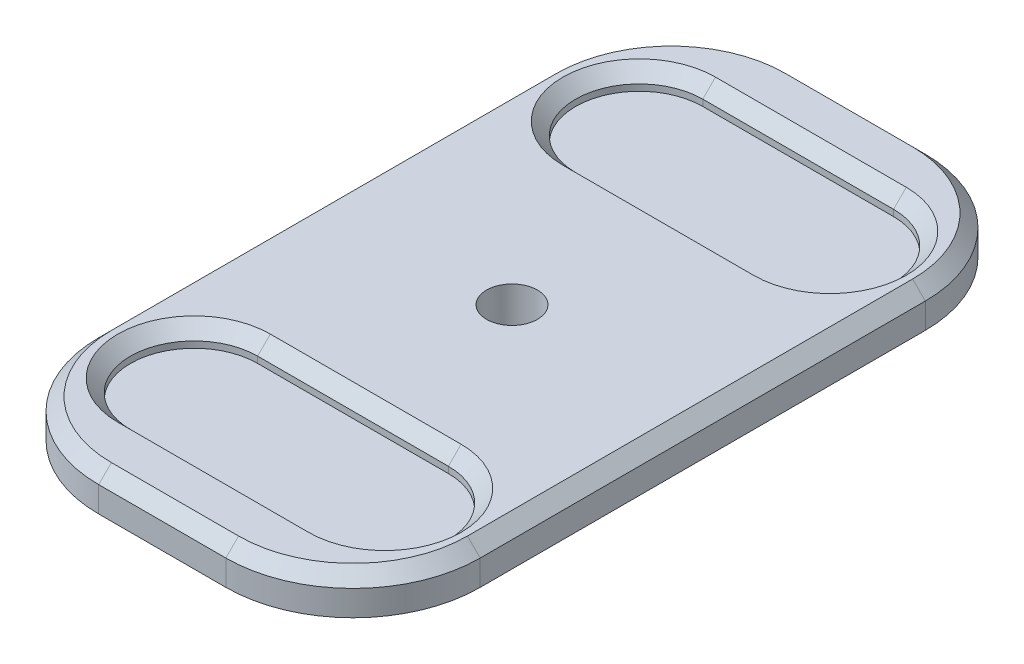
ISO-10303-21;
HEADER;
FILE_DESCRIPTION(('STEP AP214'),'2;1');
FILE_NAME('part.step','',(''),(''),'','','');
FILE_SCHEMA(('AUTOMOTIVE_DESIGN { 1 0 10303 214 1 1 1 1 }'));
ENDSEC;
DATA;
#1=APPLICATION_CONTEXT('core data for automotive mechanical design processes');
#2=APPLICATION_PROTOCOL_DEFINITION('international standard','automotive_design',2000,#1);
#3=PRODUCT_CONTEXT('',#1,'mechanical');
#4=PRODUCT('Part','Part','',(#3));
#5=PRODUCT_RELATED_PRODUCT_CATEGORY('part','',(#4));
#6=PRODUCT_DEFINITION_FORMATION('','',#4);
#7=PRODUCT_DEFINITION_CONTEXT('part definition',#1,'design');
#8=PRODUCT_DEFINITION('design','',#6,#7);
#9=PRODUCT_DEFINITION_SHAPE('','',#8);
#10=(LENGTH_UNIT() NAMED_UNIT(*) SI_UNIT(.MILLI.,.METRE.));
#11=(NAMED_UNIT(*) PLANE_ANGLE_UNIT() SI_UNIT($,.RADIAN.));
#12=(NAMED_UNIT(*) SI_UNIT($,.STERADIAN.) SOLID_ANGLE_UNIT());
#13=UNCERTAINTY_MEASURE_WITH_UNIT(LENGTH_MEASURE(1.E-05),#10,'distance_accuracy_value','');
#14=(GEOMETRIC_REPRESENTATION_CONTEXT(3) GLOBAL_UNCERTAINTY_ASSIGNED_CONTEXT((#13)) GLOBAL_UNIT_ASSIGNED_CONTEXT((#10,
#11,#12)) REPRESENTATION_CONTEXT('',''));
#15=CARTESIAN_POINT('',(0.,0.,0.));
#16=DIRECTION('',(0.,0.,1.));
#17=DIRECTION('',(1.,0.,0.));
#18=AXIS2_PLACEMENT_3D('',#15,#16,#17);
#19=CARTESIAN_POINT('',(30.,3.,0.));
#20=DIRECTION('',(-1.,0.,0.));
#21=DIRECTION('',(0.,0.,1.));
#22=AXIS2_PLACEMENT_3D('',#19,#20,#21);
#23=PLANE('',#22);
#24=DIRECTION('',(0.,1.,0.));
#25=VECTOR('',#24,1.);
#26=CARTESIAN_POINT('',(30.,3.,25.));
#27=LINE('',#26,#25);
#28=CARTESIAN_POINT('',(30.,-3.,25.));
#29=VERTEX_POINT('',#28);
#30=CARTESIAN_POINT('',(30.,0.999999999999984,25.));
#31=VERTEX_POINT('',#30);
#32=EDGE_CURVE('E264',#29,#31,#27,.T.);
#33=ORIENTED_EDGE('',*,*,#32,.T.);
#34=DIRECTION('',(0.,0.,1.));
#35=VECTOR('',#34,1.);
#36=CARTESIAN_POINT('',(30.,0.999999999999984,95.));
#37=LINE('',#36,#35);
#38=CARTESIAN_POINT('',(30.,0.999999999999984,95.));
#39=VERTEX_POINT('',#38);
#40=EDGE_CURVE('E340',#31,#39,#37,.T.);
#41=ORIENTED_EDGE('',*,*,#40,.T.);
#42=DIRECTION('',(0.,1.,0.));
#43=VECTOR('',#42,1.);
#44=CARTESIAN_POINT('',(30.,-3.,95.));
#45=LINE('',#44,#43);
#46=CARTESIAN_POINT('',(30.,-3.,95.));
#47=VERTEX_POINT('',#46);
#48=EDGE_CURVE('E267',#39,#47,#45,.F.);
#49=ORIENTED_EDGE('',*,*,#48,.T.);
#50=DIRECTION('',(0.,0.,1.));
#51=VECTOR('',#50,1.);
#52=CARTESIAN_POINT('',(30.,-3.,140.));
#53=LINE('',#52,#51);
#54=EDGE_CURVE('E253',#29,#47,#53,.T.);
#55=ORIENTED_EDGE('',*,*,#54,.F.);
#56=EDGE_LOOP('',(#33,#41,#49,#55));
#57=FACE_BOUND('',#56,.T.);
#58=ADVANCED_FACE('F32',(#57),#23,.F.);
#59=CARTESIAN_POINT('',(-30.,3.,0.));
#60=DIRECTION('',(1.,0.,0.));
#61=DIRECTION('',(0.,0.,-1.));
#62=AXIS2_PLACEMENT_3D('',#59,#60,#61);
#63=PLANE('',#62);
#64=DIRECTION('',(0.,1.,0.));
#65=VECTOR('',#64,1.);
#66=CARTESIAN_POINT('',(-30.,3.,95.));
#67=LINE('',#66,#65);
#68=CARTESIAN_POINT('',(-30.,-3.,95.));
#69=VERTEX_POINT('',#68);
#70=CARTESIAN_POINT('',(-30.,0.999999999999984,95.));
#71=VERTEX_POINT('',#70);
#72=EDGE_CURVE('E279',#69,#71,#67,.T.);
#73=ORIENTED_EDGE('',*,*,#72,.T.);
#74=DIRECTION('',(0.,0.,-1.));
#75=VECTOR('',#74,1.);
#76=CARTESIAN_POINT('',(-30.,0.999999999999984,25.));
#77=LINE('',#76,#75);
#78=CARTESIAN_POINT('',(-30.,0.999999999999987,25.));
#79=VERTEX_POINT('',#78);
#80=EDGE_CURVE('E332',#71,#79,#77,.T.);
#81=ORIENTED_EDGE('',*,*,#80,.T.);
#82=DIRECTION('',(0.,1.,0.));
#83=VECTOR('',#82,1.);
#84=CARTESIAN_POINT('',(-30.,-3.,25.));
#85=LINE('',#84,#83);
#86=CARTESIAN_POINT('',(-30.,-3.,25.));
#87=VERTEX_POINT('',#86);
#88=EDGE_CURVE('E277',#79,#87,#85,.F.);
#89=ORIENTED_EDGE('',*,*,#88,.T.);
#90=DIRECTION('',(0.,0.,-1.));
#91=VECTOR('',#90,1.);
#92=CARTESIAN_POINT('',(-30.,-3.,140.));
#93=LINE('',#92,#91);
#94=EDGE_CURVE('E250',#69,#87,#93,.T.);
#95=ORIENTED_EDGE('',*,*,#94,.F.);
#96=EDGE_LOOP('',(#73,#81,#89,#95));
#97=FACE_BOUND('',#96,.T.);
#98=ADVANCED_FACE('F427',(#97),#63,.F.);
#99=CARTESIAN_POINT('',(0.,-3.,0.));
#100=DIRECTION('',(0.,-1.,0.));
#101=DIRECTION('',(0.,0.,-1.));
#102=AXIS2_PLACEMENT_3D('',#99,#100,#101);
#103=PLANE('',#102);
#104=CARTESIAN_POINT('',(0.,-3.,60.));
#105=DIRECTION('',(0.,-1.,0.));
#106=DIRECTION('',(0.,0.,-1.));
#107=AXIS2_PLACEMENT_3D('',#104,#105,#106);
#108=CIRCLE('',#107,4.);
#109=CARTESIAN_POINT('',(0.,-3.,56.));
#110=VERTEX_POINT('',#109);
#111=EDGE_CURVE('E819',#110,#110,#108,.T.);
#112=ORIENTED_EDGE('',*,*,#111,.F.);
#113=EDGE_LOOP('',(#112));
#114=FACE_BOUND('',#113,.T.);
#115=ORIENTED_EDGE('',*,*,#54,.T.);
#116=CARTESIAN_POINT('',(10.,-3.,95.));
#117=DIRECTION('',(0.,-1.,0.));
#118=DIRECTION('',(0.,0.,-1.));
#119=AXIS2_PLACEMENT_3D('',#116,#117,#118);
#120=CIRCLE('',#119,20.);
#121=CARTESIAN_POINT('',(10.,-3.,115.));
#122=VERTEX_POINT('',#121);
#123=EDGE_CURVE('E275',#47,#122,#120,.T.);
#124=ORIENTED_EDGE('',*,*,#123,.T.);
#125=DIRECTION('',(-1.,0.,0.));
#126=VECTOR('',#125,1.);
#127=CARTESIAN_POINT('',(0.,-3.,115.));
#128=LINE('',#127,#126);
#129=CARTESIAN_POINT('',(-9.99999999999998,-3.,115.));
#130=VERTEX_POINT('',#129);
#131=EDGE_CURVE('E256',#122,#130,#128,.T.);
#132=ORIENTED_EDGE('',*,*,#131,.T.);
#133=CARTESIAN_POINT('',(-9.99999999999998,-3.,95.));
#134=DIRECTION('',(0.,-1.,0.));
#135=DIRECTION('',(0.,0.,-1.));
#136=AXIS2_PLACEMENT_3D('',#133,#134,#135);
#137=CIRCLE('',#136,20.);
#138=EDGE_CURVE('E273',#130,#69,#137,.T.);
#139=ORIENTED_EDGE('',*,*,#138,.T.);
#140=ORIENTED_EDGE('',*,*,#94,.T.);
#141=CARTESIAN_POINT('',(-9.99999999999999,-3.,25.));
#142=DIRECTION('',(0.,-1.,0.));
#143=DIRECTION('',(0.,0.,-1.));
#144=AXIS2_PLACEMENT_3D('',#141,#142,#143);
#145=CIRCLE('',#144,20.);
#146=CARTESIAN_POINT('',(-9.99999999999999,-3.,5.));
#147=VERTEX_POINT('',#146);
#148=EDGE_CURVE('E269',#87,#147,#145,.T.);
#149=ORIENTED_EDGE('',*,*,#148,.T.);
#150=DIRECTION('',(1.,0.,0.));
#151=VECTOR('',#150,1.);
#152=CARTESIAN_POINT('',(30.,-3.,5.));
#153=LINE('',#152,#151);
#154=CARTESIAN_POINT('',(10.,-3.,5.));
#155=VERTEX_POINT('',#154);
#156=EDGE_CURVE('E228',#147,#155,#153,.T.);
#157=ORIENTED_EDGE('',*,*,#156,.T.);
#158=CARTESIAN_POINT('',(10.,-3.,25.));
#159=DIRECTION('',(0.,-1.,0.));
#160=DIRECTION('',(0.,0.,-1.));
#161=AXIS2_PLACEMENT_3D('',#158,#159,#160);
#162=CIRCLE('',#161,20.);
#163=EDGE_CURVE('E271',#155,#29,#162,.T.);
#164=ORIENTED_EDGE('',*,*,#163,.T.);
#165=EDGE_LOOP('',(#115,#124,#132,#139,#140,#149,#157,#164));
#166=FACE_BOUND('',#165,.T.);
#167=ADVANCED_FACE('F418',(#114,#166),#103,.T.);
#168=CARTESIAN_POINT('',(0.,3.,0.));
#169=DIRECTION('',(0.,1.,0.));
#170=DIRECTION('',(0.,0.,1.));
#171=AXIS2_PLACEMENT_3D('',#168,#169,#170);
#172=PLANE('',#171);
#173=CARTESIAN_POINT('',(0.,3.,60.));
#174=DIRECTION('',(0.,1.,0.));
#175=DIRECTION('',(0.,0.,1.));
#176=AXIS2_PLACEMENT_3D('',#173,#174,#175);
#177=CIRCLE('',#176,4.);
#178=CARTESIAN_POINT('',(0.,3.,64.));
#179=VERTEX_POINT('',#178);
#180=EDGE_CURVE('E36',#179,#179,#177,.T.);
#181=ORIENTED_EDGE('',*,*,#180,.F.);
#182=EDGE_LOOP('',(#181));
#183=FACE_BOUND('',#182,.T.);
#184=DIRECTION('',(1.,0.,0.));
#185=VECTOR('',#184,1.);
#186=CARTESIAN_POINT('',(15.,3.,13.));
#187=LINE('',#186,#185);
#188=CARTESIAN_POINT('',(-15.,3.,13.));
#189=VERTEX_POINT('',#188);
#190=CARTESIAN_POINT('',(15.,3.,13.));
#191=VERTEX_POINT('',#190);
#192=EDGE_CURVE('E319',#189,#191,#187,.T.);
#193=ORIENTED_EDGE('',*,*,#192,.T.);
#194=CARTESIAN_POINT('',(15.,3.,25.));
#195=DIRECTION('',(0.,1.,0.));
#196=DIRECTION('',(0.,0.,1.));
#197=AXIS2_PLACEMENT_3D('',#194,#195,#196);
#198=CIRCLE('',#197,12.);
#199=CARTESIAN_POINT('',(15.,3.,37.));
#200=VERTEX_POINT('',#199);
#201=EDGE_CURVE('E321',#191,#200,#198,.F.);
#202=ORIENTED_EDGE('',*,*,#201,.T.);
#203=DIRECTION('',(-1.,0.,0.));
#204=VECTOR('',#203,1.);
#205=CARTESIAN_POINT('',(-15.,3.,37.));
#206=LINE('',#205,#204);
#207=CARTESIAN_POINT('',(-15.,3.,37.));
#208=VERTEX_POINT('',#207);
#209=EDGE_CURVE('E315',#200,#208,#206,.T.);
#210=ORIENTED_EDGE('',*,*,#209,.T.);
#211=CARTESIAN_POINT('',(-15.,3.,25.));
#212=DIRECTION('',(0.,1.,0.));
#213=DIRECTION('',(0.,0.,1.));
#214=AXIS2_PLACEMENT_3D('',#211,#212,#213);
#215=CIRCLE('',#214,12.);
#216=EDGE_CURVE('E317',#208,#189,#215,.F.);
#217=ORIENTED_EDGE('',*,*,#216,.T.);
#218=EDGE_LOOP('',(#193,#202,#210,#217));
#219=FACE_BOUND('',#218,.T.);
#220=DIRECTION('',(0.,0.,1.));
#221=VECTOR('',#220,1.);
#222=CARTESIAN_POINT('',(-28.,3.,95.));
#223=LINE('',#222,#221);
#224=CARTESIAN_POINT('',(-28.,3.,25.));
#225=VERTEX_POINT('',#224);
#226=CARTESIAN_POINT('',(-28.,3.,95.));
#227=VERTEX_POINT('',#226);
#228=EDGE_CURVE('E310',#225,#227,#223,.T.);
#229=ORIENTED_EDGE('',*,*,#228,.T.);
#230=CARTESIAN_POINT('',(-9.99999999999998,3.,95.));
#231=DIRECTION('',(0.,1.,0.));
#232=DIRECTION('',(0.,0.,1.));
#233=AXIS2_PLACEMENT_3D('',#230,#231,#232);
#234=CIRCLE('',#233,18.);
#235=CARTESIAN_POINT('',(-9.99999999999998,3.,113.));
#236=VERTEX_POINT('',#235);
#237=EDGE_CURVE('E312',#227,#236,#234,.T.);
#238=ORIENTED_EDGE('',*,*,#237,.T.);
#239=DIRECTION('',(1.,0.,0.));
#240=VECTOR('',#239,1.);
#241=CARTESIAN_POINT('',(0.,3.,113.));
#242=LINE('',#241,#240);
#243=CARTESIAN_POINT('',(10.,3.,113.));
#244=VERTEX_POINT('',#243);
#245=EDGE_CURVE('E298',#236,#244,#242,.T.);
#246=ORIENTED_EDGE('',*,*,#245,.T.);
#247=CARTESIAN_POINT('',(10.,3.,95.));
#248=DIRECTION('',(0.,1.,0.));
#249=DIRECTION('',(0.,0.,1.));
#250=AXIS2_PLACEMENT_3D('',#247,#248,#249);
#251=CIRCLE('',#250,18.);
#252=CARTESIAN_POINT('',(28.,3.,95.));
#253=VERTEX_POINT('',#252);
#254=EDGE_CURVE('E300',#244,#253,#251,.T.);
#255=ORIENTED_EDGE('',*,*,#254,.T.);
#256=DIRECTION('',(0.,0.,-1.));
#257=VECTOR('',#256,1.);
#258=CARTESIAN_POINT('',(28.,3.,25.));
#259=LINE('',#258,#257);
#260=CARTESIAN_POINT('',(28.,3.,25.));
#261=VERTEX_POINT('',#260);
#262=EDGE_CURVE('E302',#253,#261,#259,.T.);
#263=ORIENTED_EDGE('',*,*,#262,.T.);
#264=CARTESIAN_POINT('',(10.,3.,25.));
#265=DIRECTION('',(0.,1.,0.));
#266=DIRECTION('',(0.,0.,1.));
#267=AXIS2_PLACEMENT_3D('',#264,#265,#266);
#268=CIRCLE('',#267,18.);
#269=CARTESIAN_POINT('',(10.,3.,7.));
#270=VERTEX_POINT('',#269);
#271=EDGE_CURVE('E304',#261,#270,#268,.T.);
#272=ORIENTED_EDGE('',*,*,#271,.T.);
#273=DIRECTION('',(-1.,0.,0.));
#274=VECTOR('',#273,1.);
#275=CARTESIAN_POINT('',(0.,3.,7.));
#276=LINE('',#275,#274);
#277=CARTESIAN_POINT('',(-9.99999999999999,3.,7.));
#278=VERTEX_POINT('',#277);
#279=EDGE_CURVE('E306',#270,#278,#276,.T.);
#280=ORIENTED_EDGE('',*,*,#279,.T.);
#281=CARTESIAN_POINT('',(-9.99999999999999,3.,25.));
#282=DIRECTION('',(0.,1.,0.));
#283=DIRECTION('',(0.,0.,1.));
#284=AXIS2_PLACEMENT_3D('',#281,#282,#283);
#285=CIRCLE('',#284,18.);
#286=EDGE_CURVE('E308',#278,#225,#285,.T.);
#287=ORIENTED_EDGE('',*,*,#286,.T.);
#288=EDGE_LOOP('',(#229,#238,#246,#255,#263,#272,#280,#287));
#289=FACE_BOUND('',#288,.T.);
#290=CARTESIAN_POINT('',(-15.,3.,95.));
#291=DIRECTION('',(0.,1.,0.));
#292=DIRECTION('',(0.,0.,1.));
#293=AXIS2_PLACEMENT_3D('',#290,#291,#292);
#294=CIRCLE('',#293,12.);
#295=CARTESIAN_POINT('',(-15.,3.,107.));
#296=VERTEX_POINT('',#295);
#297=CARTESIAN_POINT('',(-15.,3.,83.));
#298=VERTEX_POINT('',#297);
#299=EDGE_CURVE('E293',#296,#298,#294,.F.);
#300=ORIENTED_EDGE('',*,*,#299,.T.);
#301=DIRECTION('',(1.,0.,0.));
#302=VECTOR('',#301,1.);
#303=CARTESIAN_POINT('',(15.,3.,83.));
#304=LINE('',#303,#302);
#305=CARTESIAN_POINT('',(15.,3.,83.));
#306=VERTEX_POINT('',#305);
#307=EDGE_CURVE('E295',#298,#306,#304,.T.);
#308=ORIENTED_EDGE('',*,*,#307,.T.);
#309=CARTESIAN_POINT('',(15.,3.,95.));
#310=DIRECTION('',(0.,1.,0.));
#311=DIRECTION('',(0.,0.,1.));
#312=AXIS2_PLACEMENT_3D('',#309,#310,#311);
#313=CIRCLE('',#312,12.);
#314=CARTESIAN_POINT('',(15.,3.,107.));
#315=VERTEX_POINT('',#314);
#316=EDGE_CURVE('E289',#306,#315,#313,.F.);
#317=ORIENTED_EDGE('',*,*,#316,.T.);
#318=DIRECTION('',(-1.,0.,0.));
#319=VECTOR('',#318,1.);
#320=CARTESIAN_POINT('',(-15.,3.,107.));
#321=LINE('',#320,#319);
#322=EDGE_CURVE('E291',#315,#296,#321,.T.);
#323=ORIENTED_EDGE('',*,*,#322,.T.);
#324=EDGE_LOOP('',(#300,#308,#317,#323));
#325=FACE_BOUND('',#324,.T.);
#326=ADVANCED_FACE('F416',(#183,#219,#289,#325),#172,.T.);
#327=CARTESIAN_POINT('',(15.,3.,95.));
#328=DIRECTION('',(0.,-1.,0.));
#329=DIRECTION('',(0.,0.,-1.));
#330=AXIS2_PLACEMENT_3D('',#327,#328,#329);
#331=CYLINDRICAL_SURFACE('',#330,10.);
#332=DIRECTION('',(0.,-1.,0.));
#333=VECTOR('',#332,1.);
#334=CARTESIAN_POINT('',(15.,3.,105.));
#335=LINE('',#334,#333);
#336=CARTESIAN_POINT('',(15.,1.00000000000003,105.));
#337=VERTEX_POINT('',#336);
#338=CARTESIAN_POINT('',(15.,0.,105.));
#339=VERTEX_POINT('',#338);
#340=EDGE_CURVE('E242',#337,#339,#335,.T.);
#341=ORIENTED_EDGE('',*,*,#340,.F.);
#342=CARTESIAN_POINT('',(15.,1.00000000000003,95.));
#343=DIRECTION('',(0.,1.,0.));
#344=DIRECTION('',(0.,0.,1.));
#345=AXIS2_PLACEMENT_3D('',#342,#343,#344);
#346=CIRCLE('',#345,10.);
#347=CARTESIAN_POINT('',(15.,1.00000000000003,85.));
#348=VERTEX_POINT('',#347);
#349=EDGE_CURVE('E11',#337,#348,#346,.T.);
#350=ORIENTED_EDGE('',*,*,#349,.T.);
#351=DIRECTION('',(0.,-1.,0.));
#352=VECTOR('',#351,1.);
#353=CARTESIAN_POINT('',(15.,3.,85.));
#354=LINE('',#353,#352);
#355=CARTESIAN_POINT('',(15.,0.,85.));
#356=VERTEX_POINT('',#355);
#357=EDGE_CURVE('E248',#348,#356,#354,.T.);
#358=ORIENTED_EDGE('',*,*,#357,.T.);
#359=CARTESIAN_POINT('',(15.,0.,95.));
#360=DIRECTION('',(0.,-1.,0.));
#361=DIRECTION('',(0.,0.,-1.));
#362=AXIS2_PLACEMENT_3D('',#359,#360,#361);
#363=CIRCLE('',#362,10.);
#364=EDGE_CURVE('E206',#356,#339,#363,.T.);
#365=ORIENTED_EDGE('',*,*,#364,.T.);
#366=EDGE_LOOP('',(#341,#350,#358,#365));
#367=FACE_BOUND('',#366,.T.);
#368=ADVANCED_FACE('F406',(#367),#331,.F.);
#369=CARTESIAN_POINT('',(-15.,3.,85.));
#370=DIRECTION('',(0.,0.,-1.));
#371=DIRECTION('',(-1.,0.,0.));
#372=AXIS2_PLACEMENT_3D('',#369,#370,#371);
#373=PLANE('',#372);
#374=ORIENTED_EDGE('',*,*,#357,.F.);
#375=DIRECTION('',(-1.,0.,0.));
#376=VECTOR('',#375,1.);
#377=CARTESIAN_POINT('',(-15.,1.00000000000003,85.));
#378=LINE('',#377,#376);
#379=CARTESIAN_POINT('',(-15.,1.00000000000003,85.));
#380=VERTEX_POINT('',#379);
#381=EDGE_CURVE('E346',#348,#380,#378,.T.);
#382=ORIENTED_EDGE('',*,*,#381,.T.);
#383=DIRECTION('',(0.,-1.,0.));
#384=VECTOR('',#383,1.);
#385=CARTESIAN_POINT('',(-15.,3.,85.));
#386=LINE('',#385,#384);
#387=CARTESIAN_POINT('',(-15.,0.,85.));
#388=VERTEX_POINT('',#387);
#389=EDGE_CURVE('E246',#380,#388,#386,.T.);
#390=ORIENTED_EDGE('',*,*,#389,.T.);
#391=DIRECTION('',(1.,0.,0.));
#392=VECTOR('',#391,1.);
#393=CARTESIAN_POINT('',(-15.,0.,85.));
#394=LINE('',#393,#392);
#395=EDGE_CURVE('E233',#388,#356,#394,.T.);
#396=ORIENTED_EDGE('',*,*,#395,.T.);
#397=EDGE_LOOP('',(#374,#382,#390,#396));
#398=FACE_BOUND('',#397,.T.);
#399=ADVANCED_FACE('F410',(#398),#373,.F.);
#400=CARTESIAN_POINT('',(-15.,3.,95.));
#401=DIRECTION('',(0.,-1.,0.));
#402=DIRECTION('',(0.,0.,-1.));
#403=AXIS2_PLACEMENT_3D('',#400,#401,#402);
#404=CYLINDRICAL_SURFACE('',#403,10.);
#405=ORIENTED_EDGE('',*,*,#389,.F.);
#406=CARTESIAN_POINT('',(-15.,1.00000000000003,95.));
#407=DIRECTION('',(0.,1.,0.));
#408=DIRECTION('',(0.,0.,1.));
#409=AXIS2_PLACEMENT_3D('',#406,#407,#408);
#410=CIRCLE('',#409,10.);
#411=CARTESIAN_POINT('',(-15.,1.00000000000003,105.));
#412=VERTEX_POINT('',#411);
#413=EDGE_CURVE('E56',#380,#412,#410,.T.);
#414=ORIENTED_EDGE('',*,*,#413,.T.);
#415=DIRECTION('',(0.,-1.,0.));
#416=VECTOR('',#415,1.);
#417=CARTESIAN_POINT('',(-15.,3.,105.));
#418=LINE('',#417,#416);
#419=CARTESIAN_POINT('',(-15.,0.,105.));
#420=VERTEX_POINT('',#419);
#421=EDGE_CURVE('E244',#412,#420,#418,.T.);
#422=ORIENTED_EDGE('',*,*,#421,.T.);
#423=CARTESIAN_POINT('',(-15.,0.,95.));
#424=DIRECTION('',(0.,-1.,0.));
#425=DIRECTION('',(0.,0.,-1.));
#426=AXIS2_PLACEMENT_3D('',#423,#424,#425);
#427=CIRCLE('',#426,10.);
#428=EDGE_CURVE('E236',#420,#388,#427,.T.);
#429=ORIENTED_EDGE('',*,*,#428,.T.);
#430=EDGE_LOOP('',(#405,#414,#422,#429));
#431=FACE_BOUND('',#430,.T.);
#432=ADVANCED_FACE('F661',(#431),#404,.F.);
#433=CARTESIAN_POINT('',(-15.,3.,105.));
#434=DIRECTION('',(0.,0.,1.));
#435=DIRECTION('',(1.,0.,0.));
#436=AXIS2_PLACEMENT_3D('',#433,#434,#435);
#437=PLANE('',#436);
#438=ORIENTED_EDGE('',*,*,#421,.F.);
#439=DIRECTION('',(1.,0.,0.));
#440=VECTOR('',#439,1.);
#441=CARTESIAN_POINT('',(15.,1.00000000000003,105.));
#442=LINE('',#441,#440);
#443=EDGE_CURVE('E41',#412,#337,#442,.T.);
#444=ORIENTED_EDGE('',*,*,#443,.T.);
#445=ORIENTED_EDGE('',*,*,#340,.T.);
#446=DIRECTION('',(-1.,0.,0.));
#447=VECTOR('',#446,1.);
#448=CARTESIAN_POINT('',(-15.,0.,105.));
#449=LINE('',#448,#447);
#450=EDGE_CURVE('E239',#339,#420,#449,.T.);
#451=ORIENTED_EDGE('',*,*,#450,.T.);
#452=EDGE_LOOP('',(#438,#444,#445,#451));
#453=FACE_BOUND('',#452,.T.);
#454=ADVANCED_FACE('F654',(#453),#437,.F.);
#455=CARTESIAN_POINT('',(0.,0.,120.));
#456=DIRECTION('',(0.,-1.,0.));
#457=DIRECTION('',(0.,0.,1.));
#458=AXIS2_PLACEMENT_3D('',#455,#456,#457);
#459=PLANE('',#458);
#460=ORIENTED_EDGE('',*,*,#450,.F.);
#461=ORIENTED_EDGE('',*,*,#364,.F.);
#462=ORIENTED_EDGE('',*,*,#395,.F.);
#463=ORIENTED_EDGE('',*,*,#428,.F.);
#464=EDGE_LOOP('',(#460,#461,#462,#463));
#465=FACE_BOUND('',#464,.T.);
#466=ADVANCED_FACE('F643',(#465),#459,.F.);
#467=CARTESIAN_POINT('',(-30.,-7.,115.));
#468=DIRECTION('',(0.,0.,1.));
#469=DIRECTION('',(1.,0.,0.));
#470=AXIS2_PLACEMENT_3D('',#467,#468,#469);
#471=PLANE('',#470);
#472=DIRECTION('',(0.,1.,0.));
#473=VECTOR('',#472,1.);
#474=CARTESIAN_POINT('',(10.,3.,115.));
#475=LINE('',#474,#473);
#476=CARTESIAN_POINT('',(10.,0.999999999999984,115.));
#477=VERTEX_POINT('',#476);
#478=EDGE_CURVE('E261',#122,#477,#475,.T.);
#479=ORIENTED_EDGE('',*,*,#478,.T.);
#480=DIRECTION('',(-1.,0.,0.));
#481=VECTOR('',#480,1.);
#482=CARTESIAN_POINT('',(-30.,0.999999999999984,115.));
#483=LINE('',#482,#481);
#484=CARTESIAN_POINT('',(-9.99999999999998,0.999999999999984,115.));
#485=VERTEX_POINT('',#484);
#486=EDGE_CURVE('E344',#477,#485,#483,.T.);
#487=ORIENTED_EDGE('',*,*,#486,.T.);
#488=DIRECTION('',(0.,1.,0.));
#489=VECTOR('',#488,1.);
#490=CARTESIAN_POINT('',(-9.99999999999998,-3.,115.));
#491=LINE('',#490,#489);
#492=EDGE_CURVE('E259',#485,#130,#491,.F.);
#493=ORIENTED_EDGE('',*,*,#492,.T.);
#494=ORIENTED_EDGE('',*,*,#131,.F.);
#495=EDGE_LOOP('',(#479,#487,#493,#494));
#496=FACE_BOUND('',#495,.T.);
#497=ADVANCED_FACE('F632',(#496),#471,.T.);
#498=CARTESIAN_POINT('',(-30.,-81.3941029804985,5.));
#499=DIRECTION('',(0.,0.,-1.));
#500=DIRECTION('',(-1.,0.,0.));
#501=AXIS2_PLACEMENT_3D('',#498,#499,#500);
#502=PLANE('',#501);
#503=DIRECTION('',(0.,1.,0.));
#504=VECTOR('',#503,1.);
#505=CARTESIAN_POINT('',(-9.99999999999999,3.,5.));
#506=LINE('',#505,#504);
#507=CARTESIAN_POINT('',(-9.99999999999999,0.999999999999987,5.));
#508=VERTEX_POINT('',#507);
#509=EDGE_CURVE('E282',#147,#508,#506,.T.);
#510=ORIENTED_EDGE('',*,*,#509,.T.);
#511=DIRECTION('',(1.,0.,0.));
#512=VECTOR('',#511,1.);
#513=CARTESIAN_POINT('',(-30.,0.999999999999987,5.));
#514=LINE('',#513,#512);
#515=CARTESIAN_POINT('',(10.,0.999999999999984,5.));
#516=VERTEX_POINT('',#515);
#517=EDGE_CURVE('E336',#508,#516,#514,.T.);
#518=ORIENTED_EDGE('',*,*,#517,.T.);
#519=DIRECTION('',(0.,1.,0.));
#520=VECTOR('',#519,1.);
#521=CARTESIAN_POINT('',(10.,-3.,5.));
#522=LINE('',#521,#520);
#523=EDGE_CURVE('E285',#516,#155,#522,.F.);
#524=ORIENTED_EDGE('',*,*,#523,.T.);
#525=ORIENTED_EDGE('',*,*,#156,.F.);
#526=EDGE_LOOP('',(#510,#518,#524,#525));
#527=FACE_BOUND('',#526,.T.);
#528=ADVANCED_FACE('F621',(#527),#502,.T.);
#529=CARTESIAN_POINT('',(-15.,-81.3941029804985,25.));
#530=DIRECTION('',(0.,1.,0.));
#531=DIRECTION('',(0.,0.,1.));
#532=AXIS2_PLACEMENT_3D('',#529,#530,#531);
#533=CYLINDRICAL_SURFACE('',#532,10.);
#534=DIRECTION('',(0.,1.,0.));
#535=VECTOR('',#534,1.);
#536=CARTESIAN_POINT('',(-15.,-81.3941029804985,15.));
#537=LINE('',#536,#535);
#538=CARTESIAN_POINT('',(-15.,0.,15.));
#539=VERTEX_POINT('',#538);
#540=CARTESIAN_POINT('',(-15.,0.999999999999987,15.));
#541=VERTEX_POINT('',#540);
#542=EDGE_CURVE('E225',#539,#541,#537,.T.);
#543=ORIENTED_EDGE('',*,*,#542,.T.);
#544=CARTESIAN_POINT('',(-15.,0.999999999999987,25.));
#545=DIRECTION('',(0.,1.,0.));
#546=DIRECTION('',(0.,0.,1.));
#547=AXIS2_PLACEMENT_3D('',#544,#545,#546);
#548=CIRCLE('',#547,10.);
#549=CARTESIAN_POINT('',(-15.,0.999999999999987,35.));
#550=VERTEX_POINT('',#549);
#551=EDGE_CURVE('E326',#541,#550,#548,.T.);
#552=ORIENTED_EDGE('',*,*,#551,.T.);
#553=DIRECTION('',(0.,1.,0.));
#554=VECTOR('',#553,1.);
#555=CARTESIAN_POINT('',(-15.,-81.3941029804985,35.));
#556=LINE('',#555,#554);
#557=CARTESIAN_POINT('',(-15.,0.,35.));
#558=VERTEX_POINT('',#557);
#559=EDGE_CURVE('E216',#558,#550,#556,.T.);
#560=ORIENTED_EDGE('',*,*,#559,.F.);
#561=CARTESIAN_POINT('',(-15.,0.,25.));
#562=DIRECTION('',(0.,-1.,0.));
#563=DIRECTION('',(0.,0.,-1.));
#564=AXIS2_PLACEMENT_3D('',#561,#562,#563);
#565=CIRCLE('',#564,10.);
#566=EDGE_CURVE('E219',#539,#558,#565,.F.);
#567=ORIENTED_EDGE('',*,*,#566,.F.);
#568=EDGE_LOOP('',(#543,#552,#560,#567));
#569=FACE_BOUND('',#568,.T.);
#570=ADVANCED_FACE('F611',(#569),#533,.F.);
#571=CARTESIAN_POINT('',(-15.,-81.3941029804985,15.));
#572=DIRECTION('',(0.,0.,-1.));
#573=DIRECTION('',(-1.,0.,0.));
#574=AXIS2_PLACEMENT_3D('',#571,#572,#573);
#575=PLANE('',#574);
#576=DIRECTION('',(0.,1.,0.));
#577=VECTOR('',#576,1.);
#578=CARTESIAN_POINT('',(15.,-81.3941029804985,15.));
#579=LINE('',#578,#577);
#580=CARTESIAN_POINT('',(15.,0.,15.));
#581=VERTEX_POINT('',#580);
#582=CARTESIAN_POINT('',(15.,0.999999999999987,15.));
#583=VERTEX_POINT('',#582);
#584=EDGE_CURVE('E202',#581,#583,#579,.T.);
#585=ORIENTED_EDGE('',*,*,#584,.T.);
#586=DIRECTION('',(-1.,0.,0.));
#587=VECTOR('',#586,1.);
#588=CARTESIAN_POINT('',(-15.,0.999999999999987,15.));
#589=LINE('',#588,#587);
#590=EDGE_CURVE('E324',#583,#541,#589,.T.);
#591=ORIENTED_EDGE('',*,*,#590,.T.);
#592=ORIENTED_EDGE('',*,*,#542,.F.);
#593=DIRECTION('',(-1.,0.,0.));
#594=VECTOR('',#593,1.);
#595=CARTESIAN_POINT('',(-15.,0.,15.));
#596=LINE('',#595,#594);
#597=EDGE_CURVE('E221',#581,#539,#596,.T.);
#598=ORIENTED_EDGE('',*,*,#597,.F.);
#599=EDGE_LOOP('',(#585,#591,#592,#598));
#600=FACE_BOUND('',#599,.T.);
#601=ADVANCED_FACE('F602',(#600),#575,.F.);
#602=CARTESIAN_POINT('',(15.,-81.3941029804985,25.));
#603=DIRECTION('',(0.,1.,0.));
#604=DIRECTION('',(0.,0.,1.));
#605=AXIS2_PLACEMENT_3D('',#602,#603,#604);
#606=CYLINDRICAL_SURFACE('',#605,10.);
#607=DIRECTION('',(0.,1.,0.));
#608=VECTOR('',#607,1.);
#609=CARTESIAN_POINT('',(15.,-81.3941029804985,35.));
#610=LINE('',#609,#608);
#611=CARTESIAN_POINT('',(15.,0.,35.));
#612=VERTEX_POINT('',#611);
#613=CARTESIAN_POINT('',(15.,0.999999999999987,35.));
#614=VERTEX_POINT('',#613);
#615=EDGE_CURVE('E199',#612,#614,#610,.T.);
#616=ORIENTED_EDGE('',*,*,#615,.T.);
#617=CARTESIAN_POINT('',(15.,0.999999999999987,25.));
#618=DIRECTION('',(0.,1.,0.));
#619=DIRECTION('',(0.,0.,1.));
#620=AXIS2_PLACEMENT_3D('',#617,#618,#619);
#621=CIRCLE('',#620,10.);
#622=EDGE_CURVE('E287',#614,#583,#621,.T.);
#623=ORIENTED_EDGE('',*,*,#622,.T.);
#624=ORIENTED_EDGE('',*,*,#584,.F.);
#625=CARTESIAN_POINT('',(15.,0.,25.));
#626=DIRECTION('',(0.,-1.,0.));
#627=DIRECTION('',(0.,0.,-1.));
#628=AXIS2_PLACEMENT_3D('',#625,#626,#627);
#629=CIRCLE('',#628,10.);
#630=EDGE_CURVE('E195',#612,#581,#629,.F.);
#631=ORIENTED_EDGE('',*,*,#630,.F.);
#632=EDGE_LOOP('',(#616,#623,#624,#631));
#633=FACE_BOUND('',#632,.T.);
#634=ADVANCED_FACE('F197',(#633),#606,.F.);
#635=CARTESIAN_POINT('',(-15.,-81.3941029804985,35.));
#636=DIRECTION('',(0.,0.,1.));
#637=DIRECTION('',(1.,0.,0.));
#638=AXIS2_PLACEMENT_3D('',#635,#636,#637);
#639=PLANE('',#638);
#640=ORIENTED_EDGE('',*,*,#559,.T.);
#641=DIRECTION('',(1.,0.,0.));
#642=VECTOR('',#641,1.);
#643=CARTESIAN_POINT('',(15.,0.999999999999987,35.));
#644=LINE('',#643,#642);
#645=EDGE_CURVE('E215',#550,#614,#644,.T.);
#646=ORIENTED_EDGE('',*,*,#645,.T.);
#647=ORIENTED_EDGE('',*,*,#615,.F.);
#648=DIRECTION('',(1.,0.,0.));
#649=VECTOR('',#648,1.);
#650=CARTESIAN_POINT('',(-15.,0.,35.));
#651=LINE('',#650,#649);
#652=EDGE_CURVE('E207',#558,#612,#651,.T.);
#653=ORIENTED_EDGE('',*,*,#652,.F.);
#654=EDGE_LOOP('',(#640,#646,#647,#653));
#655=FACE_BOUND('',#654,.T.);
#656=ADVANCED_FACE('F212',(#655),#639,.F.);
#657=CARTESIAN_POINT('',(0.,0.,0.));
#658=DIRECTION('',(0.,-1.,0.));
#659=DIRECTION('',(0.,0.,-1.));
#660=AXIS2_PLACEMENT_3D('',#657,#658,#659);
#661=PLANE('',#660);
#662=ORIENTED_EDGE('',*,*,#597,.T.);
#663=ORIENTED_EDGE('',*,*,#566,.T.);
#664=ORIENTED_EDGE('',*,*,#652,.T.);
#665=ORIENTED_EDGE('',*,*,#630,.T.);
#666=EDGE_LOOP('',(#662,#663,#664,#665));
#667=FACE_BOUND('',#666,.T.);
#668=ADVANCED_FACE('F218',(#667),#661,.F.);
#669=CARTESIAN_POINT('',(10.,-7.,95.));
#670=DIRECTION('',(0.,-1.,0.));
#671=DIRECTION('',(0.,0.,-1.));
#672=AXIS2_PLACEMENT_3D('',#669,#670,#671);
#673=CYLINDRICAL_SURFACE('',#672,20.);
#674=ORIENTED_EDGE('',*,*,#48,.F.);
#675=CARTESIAN_POINT('',(10.,0.999999999999984,95.));
#676=DIRECTION('',(0.,1.,0.));
#677=DIRECTION('',(0.,0.,1.));
#678=AXIS2_PLACEMENT_3D('',#675,#676,#677);
#679=CIRCLE('',#678,20.);
#680=EDGE_CURVE('E342',#39,#477,#679,.F.);
#681=ORIENTED_EDGE('',*,*,#680,.T.);
#682=ORIENTED_EDGE('',*,*,#478,.F.);
#683=ORIENTED_EDGE('',*,*,#123,.F.);
#684=EDGE_LOOP('',(#674,#681,#682,#683));
#685=FACE_BOUND('',#684,.T.);
#686=ADVANCED_FACE('F442',(#685),#673,.T.);
#687=CARTESIAN_POINT('',(-9.99999999999998,3.,95.));
#688=DIRECTION('',(0.,-1.,0.));
#689=DIRECTION('',(0.,0.,-1.));
#690=AXIS2_PLACEMENT_3D('',#687,#688,#689);
#691=CYLINDRICAL_SURFACE('',#690,20.);
#692=ORIENTED_EDGE('',*,*,#492,.F.);
#693=CARTESIAN_POINT('',(-9.99999999999998,0.999999999999984,95.));
#694=DIRECTION('',(0.,1.,0.));
#695=DIRECTION('',(0.,0.,1.));
#696=AXIS2_PLACEMENT_3D('',#693,#694,#695);
#697=CIRCLE('',#696,20.);
#698=EDGE_CURVE('E329',#485,#71,#697,.F.);
#699=ORIENTED_EDGE('',*,*,#698,.T.);
#700=ORIENTED_EDGE('',*,*,#72,.F.);
#701=ORIENTED_EDGE('',*,*,#138,.F.);
#702=EDGE_LOOP('',(#692,#699,#700,#701));
#703=FACE_BOUND('',#702,.T.);
#704=ADVANCED_FACE('F445',(#703),#691,.T.);
#705=CARTESIAN_POINT('',(10.,3.,25.));
#706=DIRECTION('',(0.,-1.,0.));
#707=DIRECTION('',(0.,0.,-1.));
#708=AXIS2_PLACEMENT_3D('',#705,#706,#707);
#709=CYLINDRICAL_SURFACE('',#708,20.);
#710=ORIENTED_EDGE('',*,*,#523,.F.);
#711=CARTESIAN_POINT('',(10.,0.999999999999984,25.));
#712=DIRECTION('',(0.,1.,0.));
#713=DIRECTION('',(0.,0.,1.));
#714=AXIS2_PLACEMENT_3D('',#711,#712,#713);
#715=CIRCLE('',#714,20.);
#716=EDGE_CURVE('E338',#516,#31,#715,.F.);
#717=ORIENTED_EDGE('',*,*,#716,.T.);
#718=ORIENTED_EDGE('',*,*,#32,.F.);
#719=ORIENTED_EDGE('',*,*,#163,.F.);
#720=EDGE_LOOP('',(#710,#717,#718,#719));
#721=FACE_BOUND('',#720,.T.);
#722=ADVANCED_FACE('F449',(#721),#709,.T.);
#723=CARTESIAN_POINT('',(-9.99999999999999,-81.3941029804985,25.));
#724=DIRECTION('',(0.,-1.,0.));
#725=DIRECTION('',(0.,0.,-1.));
#726=AXIS2_PLACEMENT_3D('',#723,#724,#725);
#727=CYLINDRICAL_SURFACE('',#726,20.);
#728=ORIENTED_EDGE('',*,*,#88,.F.);
#729=CARTESIAN_POINT('',(-9.99999999999999,0.999999999999987,25.));
#730=DIRECTION('',(0.,1.,0.));
#731=DIRECTION('',(0.,0.,1.));
#732=AXIS2_PLACEMENT_3D('',#729,#730,#731);
#733=CIRCLE('',#732,20.);
#734=EDGE_CURVE('E334',#79,#508,#733,.F.);
#735=ORIENTED_EDGE('',*,*,#734,.T.);
#736=ORIENTED_EDGE('',*,*,#509,.F.);
#737=ORIENTED_EDGE('',*,*,#148,.F.);
#738=EDGE_LOOP('',(#728,#735,#736,#737));
#739=FACE_BOUND('',#738,.T.);
#740=ADVANCED_FACE('F453',(#739),#727,.T.);
#741=CARTESIAN_POINT('',(-15.,0.999999999999987,25.));
#742=DIRECTION('',(0.,1.,0.));
#743=DIRECTION('',(0.,0.,1.));
#744=AXIS2_PLACEMENT_3D('',#741,#742,#743);
#745=CONICAL_SURFACE('',#744,10.,0.785398163397449);
#746=DIRECTION('',(0.,-0.707106781186547,0.707106781186548));
#747=VECTOR('',#746,1.);
#748=CARTESIAN_POINT('',(-15.,3.,13.));
#749=LINE('',#748,#747);
#750=EDGE_CURVE('E356',#189,#541,#749,.T.);
#751=ORIENTED_EDGE('',*,*,#750,.F.);
#752=ORIENTED_EDGE('',*,*,#216,.F.);
#753=DIRECTION('',(0.,0.707106781186547,0.707106781186548));
#754=VECTOR('',#753,1.);
#755=CARTESIAN_POINT('',(-15.,0.999999999999987,35.));
#756=LINE('',#755,#754);
#757=EDGE_CURVE('E359',#550,#208,#756,.T.);
#758=ORIENTED_EDGE('',*,*,#757,.F.);
#759=ORIENTED_EDGE('',*,*,#551,.F.);
#760=EDGE_LOOP('',(#751,#752,#758,#759));
#761=FACE_BOUND('',#760,.T.);
#762=ADVANCED_FACE('F457',(#761),#745,.F.);
#763=CARTESIAN_POINT('',(-15.,0.999999999999987,35.));
#764=DIRECTION('',(0.,0.707106781186548,-0.707106781186547));
#765=DIRECTION('',(-1.,0.,0.));
#766=AXIS2_PLACEMENT_3D('',#763,#764,#765);
#767=PLANE('',#766);
#768=ORIENTED_EDGE('',*,*,#757,.T.);
#769=ORIENTED_EDGE('',*,*,#209,.F.);
#770=DIRECTION('',(0.,0.707106781186547,0.707106781186548));
#771=VECTOR('',#770,1.);
#772=CARTESIAN_POINT('',(15.,0.999999999999987,35.));
#773=LINE('',#772,#771);
#774=EDGE_CURVE('E353',#614,#200,#773,.T.);
#775=ORIENTED_EDGE('',*,*,#774,.F.);
#776=ORIENTED_EDGE('',*,*,#645,.F.);
#777=EDGE_LOOP('',(#768,#769,#775,#776));
#778=FACE_BOUND('',#777,.T.);
#779=ADVANCED_FACE('F467',(#778),#767,.T.);
#780=CARTESIAN_POINT('',(-15.,0.999999999999987,15.));
#781=DIRECTION('',(0.,0.707106781186548,0.707106781186547));
#782=DIRECTION('',(1.,0.,0.));
#783=AXIS2_PLACEMENT_3D('',#780,#781,#782);
#784=PLANE('',#783);
#785=ORIENTED_EDGE('',*,*,#750,.T.);
#786=ORIENTED_EDGE('',*,*,#590,.F.);
#787=DIRECTION('',(0.,-0.707106781186547,0.707106781186548));
#788=VECTOR('',#787,1.);
#789=CARTESIAN_POINT('',(15.,3.,13.));
#790=LINE('',#789,#788);
#791=EDGE_CURVE('E351',#191,#583,#790,.T.);
#792=ORIENTED_EDGE('',*,*,#791,.F.);
#793=ORIENTED_EDGE('',*,*,#192,.F.);
#794=EDGE_LOOP('',(#785,#786,#792,#793));
#795=FACE_BOUND('',#794,.T.);
#796=ADVANCED_FACE('F463',(#795),#784,.T.);
#797=CARTESIAN_POINT('',(15.,0.999999999999987,25.));
#798=DIRECTION('',(0.,1.,0.));
#799=DIRECTION('',(0.,0.,1.));
#800=AXIS2_PLACEMENT_3D('',#797,#798,#799);
#801=CONICAL_SURFACE('',#800,10.,0.785398163397448);
#802=ORIENTED_EDGE('',*,*,#774,.T.);
#803=ORIENTED_EDGE('',*,*,#201,.F.);
#804=ORIENTED_EDGE('',*,*,#791,.T.);
#805=ORIENTED_EDGE('',*,*,#622,.F.);
#806=EDGE_LOOP('',(#802,#803,#804,#805));
#807=FACE_BOUND('',#806,.T.);
#808=ADVANCED_FACE('F459',(#807),#801,.F.);
#809=CARTESIAN_POINT('',(10.,3.,25.));
#810=DIRECTION('',(0.,-1.,0.));
#811=DIRECTION('',(0.,0.,-1.));
#812=AXIS2_PLACEMENT_3D('',#809,#810,#811);
#813=CONICAL_SURFACE('',#812,18.,0.785398163397445);
#814=DIRECTION('',(-0.707106781186545,0.70710678118655,0.));
#815=VECTOR('',#814,1.);
#816=CARTESIAN_POINT('',(30.,0.999999999999984,25.));
#817=LINE('',#816,#815);
#818=EDGE_CURVE('E379',#31,#261,#817,.T.);
#819=ORIENTED_EDGE('',*,*,#818,.F.);
#820=ORIENTED_EDGE('',*,*,#716,.F.);
#821=DIRECTION('',(0.,-0.70710678118655,-0.707106781186545));
#822=VECTOR('',#821,1.);
#823=CARTESIAN_POINT('',(10.,3.,7.));
#824=LINE('',#823,#822);
#825=EDGE_CURVE('E354',#270,#516,#824,.T.);
#826=ORIENTED_EDGE('',*,*,#825,.F.);
#827=ORIENTED_EDGE('',*,*,#271,.F.);
#828=EDGE_LOOP('',(#819,#820,#826,#827));
#829=FACE_BOUND('',#828,.T.);
#830=ADVANCED_FACE('F462',(#829),#813,.T.);
#831=CARTESIAN_POINT('',(0.,3.,7.));
#832=DIRECTION('',(0.,-0.707106781186546,0.70710678118655));
#833=DIRECTION('',(-1.,0.,0.));
#834=AXIS2_PLACEMENT_3D('',#831,#832,#833);
#835=PLANE('',#834);
#836=ORIENTED_EDGE('',*,*,#825,.T.);
#837=ORIENTED_EDGE('',*,*,#517,.F.);
#838=DIRECTION('',(0.,-0.70710678118655,-0.707106781186546));
#839=VECTOR('',#838,1.);
#840=CARTESIAN_POINT('',(-9.99999999999999,3.,7.));
#841=LINE('',#840,#839);
#842=EDGE_CURVE('E376',#278,#508,#841,.T.);
#843=ORIENTED_EDGE('',*,*,#842,.F.);
#844=ORIENTED_EDGE('',*,*,#279,.F.);
#845=EDGE_LOOP('',(#836,#837,#843,#844));
#846=FACE_BOUND('',#845,.T.);
#847=ADVANCED_FACE('F498',(#846),#835,.F.);
#848=CARTESIAN_POINT('',(30.,0.999999999999984,0.));
#849=DIRECTION('',(0.70710678118655,0.707106781186545,0.));
#850=DIRECTION('',(0.,0.,-1.));
#851=AXIS2_PLACEMENT_3D('',#848,#849,#850);
#852=PLANE('',#851);
#853=ORIENTED_EDGE('',*,*,#818,.T.);
#854=ORIENTED_EDGE('',*,*,#262,.F.);
#855=DIRECTION('',(-0.707106781186545,0.70710678118655,0.));
#856=VECTOR('',#855,1.);
#857=CARTESIAN_POINT('',(30.,0.999999999999984,95.));
#858=LINE('',#857,#856);
#859=EDGE_CURVE('E373',#39,#253,#858,.T.);
#860=ORIENTED_EDGE('',*,*,#859,.F.);
#861=ORIENTED_EDGE('',*,*,#40,.F.);
#862=EDGE_LOOP('',(#853,#854,#860,#861));
#863=FACE_BOUND('',#862,.T.);
#864=ADVANCED_FACE('F494',(#863),#852,.T.);
#865=CARTESIAN_POINT('',(-9.99999999999999,3.,25.));
#866=DIRECTION('',(0.,-1.,0.));
#867=DIRECTION('',(0.,0.,-1.));
#868=AXIS2_PLACEMENT_3D('',#865,#866,#867);
#869=CONICAL_SURFACE('',#868,18.,0.785398163397445);
#870=ORIENTED_EDGE('',*,*,#842,.T.);
#871=ORIENTED_EDGE('',*,*,#734,.F.);
#872=DIRECTION('',(-0.707106781186545,-0.70710678118655,0.));
#873=VECTOR('',#872,1.);
#874=CARTESIAN_POINT('',(-28.,3.,25.));
#875=LINE('',#874,#873);
#876=EDGE_CURVE('E370',#225,#79,#875,.T.);
#877=ORIENTED_EDGE('',*,*,#876,.F.);
#878=ORIENTED_EDGE('',*,*,#286,.F.);
#879=EDGE_LOOP('',(#870,#871,#877,#878));
#880=FACE_BOUND('',#879,.T.);
#881=ADVANCED_FACE('F490',(#880),#869,.T.);
#882=CARTESIAN_POINT('',(10.,3.,95.));
#883=DIRECTION('',(0.,-1.,0.));
#884=DIRECTION('',(0.,0.,-1.));
#885=AXIS2_PLACEMENT_3D('',#882,#883,#884);
#886=CONICAL_SURFACE('',#885,18.,0.785398163397444);
#887=ORIENTED_EDGE('',*,*,#859,.T.);
#888=ORIENTED_EDGE('',*,*,#254,.F.);
#889=DIRECTION('',(0.,0.70710678118655,-0.707106781186545));
#890=VECTOR('',#889,1.);
#891=CARTESIAN_POINT('',(10.,0.999999999999984,115.));
#892=LINE('',#891,#890);
#893=EDGE_CURVE('E367',#477,#244,#892,.T.);
#894=ORIENTED_EDGE('',*,*,#893,.F.);
#895=ORIENTED_EDGE('',*,*,#680,.F.);
#896=EDGE_LOOP('',(#887,#888,#894,#895));
#897=FACE_BOUND('',#896,.T.);
#898=ADVANCED_FACE('F486',(#897),#886,.T.);
#899=CARTESIAN_POINT('',(-30.,0.999999999999984,0.));
#900=DIRECTION('',(-0.70710678118655,0.707106781186545,0.));
#901=DIRECTION('',(0.,0.,1.));
#902=AXIS2_PLACEMENT_3D('',#899,#900,#901);
#903=PLANE('',#902);
#904=ORIENTED_EDGE('',*,*,#876,.T.);
#905=ORIENTED_EDGE('',*,*,#80,.F.);
#906=DIRECTION('',(-0.707106781186545,-0.70710678118655,0.));
#907=VECTOR('',#906,1.);
#908=CARTESIAN_POINT('',(-28.,3.,95.));
#909=LINE('',#908,#907);
#910=EDGE_CURVE('E364',#227,#71,#909,.T.);
#911=ORIENTED_EDGE('',*,*,#910,.F.);
#912=ORIENTED_EDGE('',*,*,#228,.F.);
#913=EDGE_LOOP('',(#904,#905,#911,#912));
#914=FACE_BOUND('',#913,.T.);
#915=ADVANCED_FACE('F482',(#914),#903,.T.);
#916=CARTESIAN_POINT('',(0.,3.,113.));
#917=DIRECTION('',(0.,-0.707106781186545,-0.70710678118655));
#918=DIRECTION('',(1.,0.,0.));
#919=AXIS2_PLACEMENT_3D('',#916,#917,#918);
#920=PLANE('',#919);
#921=ORIENTED_EDGE('',*,*,#893,.T.);
#922=ORIENTED_EDGE('',*,*,#245,.F.);
#923=DIRECTION('',(0.,0.70710678118655,-0.707106781186545));
#924=VECTOR('',#923,1.);
#925=CARTESIAN_POINT('',(-9.99999999999998,0.999999999999984,115.));
#926=LINE('',#925,#924);
#927=EDGE_CURVE('E362',#485,#236,#926,.T.);
#928=ORIENTED_EDGE('',*,*,#927,.F.);
#929=ORIENTED_EDGE('',*,*,#486,.F.);
#930=EDGE_LOOP('',(#921,#922,#928,#929));
#931=FACE_BOUND('',#930,.T.);
#932=ADVANCED_FACE('F478',(#931),#920,.F.);
#933=CARTESIAN_POINT('',(-9.99999999999998,3.,95.));
#934=DIRECTION('',(0.,-1.,0.));
#935=DIRECTION('',(0.,0.,-1.));
#936=AXIS2_PLACEMENT_3D('',#933,#934,#935);
#937=CONICAL_SURFACE('',#936,18.,0.785398163397445);
#938=ORIENTED_EDGE('',*,*,#910,.T.);
#939=ORIENTED_EDGE('',*,*,#698,.F.);
#940=ORIENTED_EDGE('',*,*,#927,.T.);
#941=ORIENTED_EDGE('',*,*,#237,.F.);
#942=EDGE_LOOP('',(#938,#939,#940,#941));
#943=FACE_BOUND('',#942,.T.);
#944=ADVANCED_FACE('F475',(#943),#937,.T.);
#945=CARTESIAN_POINT('',(0.,3.,107.));
#946=DIRECTION('',(0.,0.707106781186545,-0.70710678118655));
#947=DIRECTION('',(1.,0.,0.));
#948=AXIS2_PLACEMENT_3D('',#945,#946,#947);
#949=PLANE('',#948);
#950=DIRECTION('',(0.,0.70710678118655,0.707106781186545));
#951=VECTOR('',#950,1.);
#952=CARTESIAN_POINT('',(15.,1.00000000000003,105.));
#953=LINE('',#952,#951);
#954=EDGE_CURVE('E388',#337,#315,#953,.T.);
#955=ORIENTED_EDGE('',*,*,#954,.F.);
#956=ORIENTED_EDGE('',*,*,#443,.F.);
#957=DIRECTION('',(0.,-0.70710678118655,-0.707106781186545));
#958=VECTOR('',#957,1.);
#959=CARTESIAN_POINT('',(-15.,3.,107.));
#960=LINE('',#959,#958);
#961=EDGE_CURVE('E365',#296,#412,#960,.T.);
#962=ORIENTED_EDGE('',*,*,#961,.F.);
#963=ORIENTED_EDGE('',*,*,#322,.F.);
#964=EDGE_LOOP('',(#955,#956,#962,#963));
#965=FACE_BOUND('',#964,.T.);
#966=ADVANCED_FACE('F34',(#965),#949,.T.);
#967=CARTESIAN_POINT('',(-15.,3.,95.));
#968=DIRECTION('',(0.,1.,0.));
#969=DIRECTION('',(0.,0.,1.));
#970=AXIS2_PLACEMENT_3D('',#967,#968,#969);
#971=CONICAL_SURFACE('',#970,12.,0.785398163397447);
#972=ORIENTED_EDGE('',*,*,#961,.T.);
#973=ORIENTED_EDGE('',*,*,#413,.F.);
#974=DIRECTION('',(0.,-0.70710678118655,0.707106781186545));
#975=VECTOR('',#974,1.);
#976=CARTESIAN_POINT('',(-15.,3.,83.));
#977=LINE('',#976,#975);
#978=EDGE_CURVE('E386',#298,#380,#977,.T.);
#979=ORIENTED_EDGE('',*,*,#978,.F.);
#980=ORIENTED_EDGE('',*,*,#299,.F.);
#981=EDGE_LOOP('',(#972,#973,#979,#980));
#982=FACE_BOUND('',#981,.T.);
#983=ADVANCED_FACE('F394',(#982),#971,.F.);
#984=CARTESIAN_POINT('',(15.,3.,95.));
#985=DIRECTION('',(0.,1.,0.));
#986=DIRECTION('',(0.,0.,1.));
#987=AXIS2_PLACEMENT_3D('',#984,#985,#986);
#988=CONICAL_SURFACE('',#987,12.,0.785398163397447);
#989=ORIENTED_EDGE('',*,*,#954,.T.);
#990=ORIENTED_EDGE('',*,*,#316,.F.);
#991=DIRECTION('',(0.,0.70710678118655,-0.707106781186545));
#992=VECTOR('',#991,1.);
#993=CARTESIAN_POINT('',(15.,1.00000000000003,85.));
#994=LINE('',#993,#992);
#995=EDGE_CURVE('E384',#348,#306,#994,.T.);
#996=ORIENTED_EDGE('',*,*,#995,.F.);
#997=ORIENTED_EDGE('',*,*,#349,.F.);
#998=EDGE_LOOP('',(#989,#990,#996,#997));
#999=FACE_BOUND('',#998,.T.);
#1000=ADVANCED_FACE('F403',(#999),#988,.F.);
#1001=CARTESIAN_POINT('',(0.,3.,83.));
#1002=DIRECTION('',(0.,0.707106781186547,0.707106781186547));
#1003=DIRECTION('',(-1.,0.,0.));
#1004=AXIS2_PLACEMENT_3D('',#1001,#1002,#1003);
#1005=PLANE('',#1004);
#1006=ORIENTED_EDGE('',*,*,#978,.T.);
#1007=ORIENTED_EDGE('',*,*,#381,.F.);
#1008=ORIENTED_EDGE('',*,*,#995,.T.);
#1009=ORIENTED_EDGE('',*,*,#307,.F.);
#1010=EDGE_LOOP('',(#1006,#1007,#1008,#1009));
#1011=FACE_BOUND('',#1010,.T.);
#1012=ADVANCED_FACE('F413',(#1011),#1005,.T.);
#1013=CARTESIAN_POINT('',(0.,7.,60.));
#1014=DIRECTION('',(0.,-1.,0.));
#1015=DIRECTION('',(0.,0.,-1.));
#1016=AXIS2_PLACEMENT_3D('',#1013,#1014,#1015);
#1017=CYLINDRICAL_SURFACE('',#1016,4.);
#1018=ORIENTED_EDGE('',*,*,#180,.T.);
#1019=EDGE_LOOP('',(#1018));
#1020=FACE_BOUND('',#1019,.T.);
#1021=ORIENTED_EDGE('',*,*,#111,.T.);
#1022=EDGE_LOOP('',(#1021));
#1023=FACE_BOUND('',#1022,.T.);
#1024=ADVANCED_FACE('F508',(#1020,#1023),#1017,.F.);
#1025=CLOSED_SHELL('',(#58,#98,#167,#326,#368,#399,#432,#454,#466,#497,#528,#570,#601,#634,#656,
#668,#686,#704,#722,#740,#762,#779,#796,#808,#830,#847,#864,#881,#898,#915,#932,#944,#966,#983,
#1000,#1012,#1024));
#1026=MANIFOLD_SOLID_BREP('B2',#1025);
#1027=ADVANCED_BREP_SHAPE_REPRESENTATION('',(#18,#1026),#14);
#1028=SHAPE_DEFINITION_REPRESENTATION(#9,#1027);
ENDSEC;
END-ISO-10303-21;
